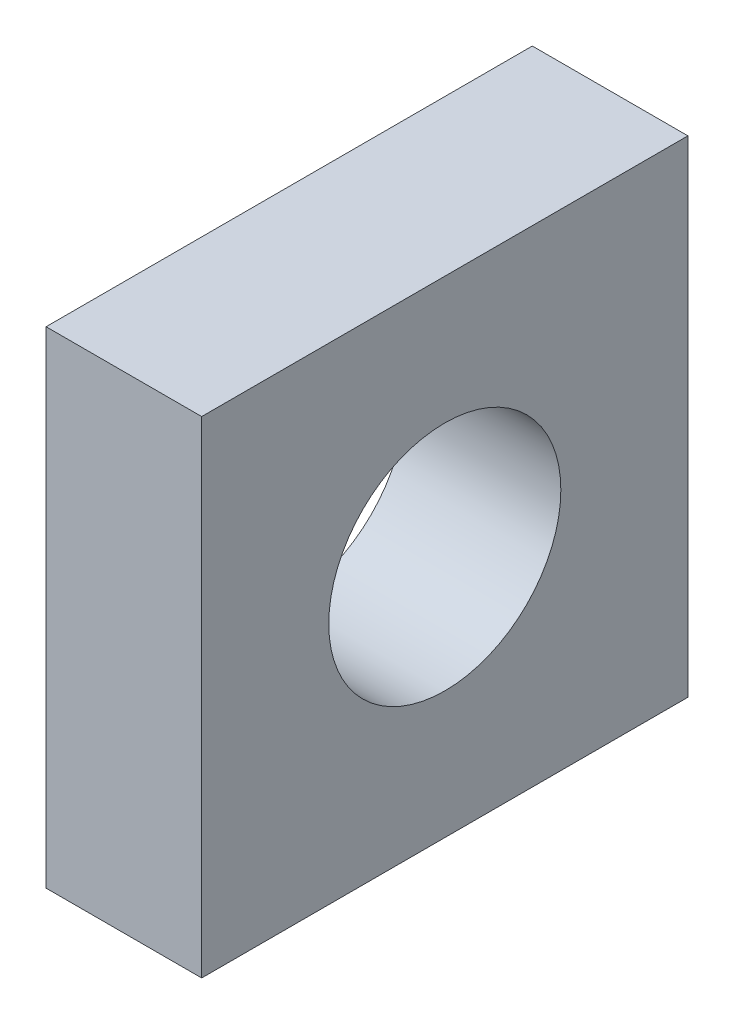
ISO-10303-21;
HEADER;
FILE_DESCRIPTION(('STEP AP214'),'2;1');
FILE_NAME('part.step','',(''),(''),'','','');
FILE_SCHEMA(('AUTOMOTIVE_DESIGN { 1 0 10303 214 1 1 1 1 }'));
ENDSEC;
DATA;
#1=APPLICATION_CONTEXT('core data for automotive mechanical design processes');
#2=APPLICATION_PROTOCOL_DEFINITION('international standard','automotive_design',2000,#1);
#3=PRODUCT_CONTEXT('',#1,'mechanical');
#4=PRODUCT('Part','Part','',(#3));
#5=PRODUCT_RELATED_PRODUCT_CATEGORY('part','',(#4));
#6=PRODUCT_DEFINITION_FORMATION('','',#4);
#7=PRODUCT_DEFINITION_CONTEXT('part definition',#1,'design');
#8=PRODUCT_DEFINITION('design','',#6,#7);
#9=PRODUCT_DEFINITION_SHAPE('','',#8);
#10=(LENGTH_UNIT() NAMED_UNIT(*) SI_UNIT(.MILLI.,.METRE.));
#11=(NAMED_UNIT(*) PLANE_ANGLE_UNIT() SI_UNIT($,.RADIAN.));
#12=(NAMED_UNIT(*) SI_UNIT($,.STERADIAN.) SOLID_ANGLE_UNIT());
#13=UNCERTAINTY_MEASURE_WITH_UNIT(LENGTH_MEASURE(1.E-05),#10,'distance_accuracy_value','');
#14=(GEOMETRIC_REPRESENTATION_CONTEXT(3) GLOBAL_UNCERTAINTY_ASSIGNED_CONTEXT((#13)) GLOBAL_UNIT_ASSIGNED_CONTEXT((#10,
#11,#12)) REPRESENTATION_CONTEXT('',''));
#15=CARTESIAN_POINT('',(0.,0.,0.));
#16=DIRECTION('',(0.,0.,1.));
#17=DIRECTION('',(1.,0.,0.));
#18=AXIS2_PLACEMENT_3D('',#15,#16,#17);
#19=CARTESIAN_POINT('',(6.6,19.,29.));
#20=DIRECTION('',(0.,0.,-1.));
#21=DIRECTION('',(-1.,0.,0.));
#22=AXIS2_PLACEMENT_3D('',#19,#20,#21);
#23=PLANE('',#22);
#24=DIRECTION('',(0.,-1.,0.));
#25=VECTOR('',#24,1.);
#26=CARTESIAN_POINT('',(3.4,19.,29.));
#27=LINE('',#26,#25);
#28=CARTESIAN_POINT('',(3.4,19.,29.));
#29=VERTEX_POINT('',#28);
#30=CARTESIAN_POINT('',(3.4,9.,29.));
#31=VERTEX_POINT('',#30);
#32=EDGE_CURVE('E100',#29,#31,#27,.T.);
#33=ORIENTED_EDGE('',*,*,#32,.F.);
#34=DIRECTION('',(-1.,0.,0.));
#35=VECTOR('',#34,1.);
#36=CARTESIAN_POINT('',(6.6,19.,29.));
#37=LINE('',#36,#35);
#38=CARTESIAN_POINT('',(6.6,19.,29.));
#39=VERTEX_POINT('',#38);
#40=EDGE_CURVE('E11',#39,#29,#37,.T.);
#41=ORIENTED_EDGE('',*,*,#40,.F.);
#42=DIRECTION('',(0.,-1.,0.));
#43=VECTOR('',#42,1.);
#44=CARTESIAN_POINT('',(6.6,19.,29.));
#45=LINE('',#44,#43);
#46=CARTESIAN_POINT('',(6.6,9.,29.));
#47=VERTEX_POINT('',#46);
#48=EDGE_CURVE('E93',#39,#47,#45,.T.);
#49=ORIENTED_EDGE('',*,*,#48,.T.);
#50=DIRECTION('',(-1.,0.,0.));
#51=VECTOR('',#50,1.);
#52=CARTESIAN_POINT('',(6.6,9.,29.));
#53=LINE('',#52,#51);
#54=EDGE_CURVE('E38',#47,#31,#53,.T.);
#55=ORIENTED_EDGE('',*,*,#54,.T.);
#56=EDGE_LOOP('',(#33,#41,#49,#55));
#57=FACE_BOUND('',#56,.T.);
#58=ADVANCED_FACE('F35',(#57),#23,.T.);
#59=CARTESIAN_POINT('',(6.6,19.,39.));
#60=DIRECTION('',(0.,1.,0.));
#61=DIRECTION('',(0.,0.,1.));
#62=AXIS2_PLACEMENT_3D('',#59,#60,#61);
#63=PLANE('',#62);
#64=DIRECTION('',(0.,0.,-1.));
#65=VECTOR('',#64,1.);
#66=CARTESIAN_POINT('',(3.4,19.,39.));
#67=LINE('',#66,#65);
#68=CARTESIAN_POINT('',(3.4,19.,39.));
#69=VERTEX_POINT('',#68);
#70=EDGE_CURVE('E95',#69,#29,#67,.T.);
#71=ORIENTED_EDGE('',*,*,#70,.F.);
#72=DIRECTION('',(-1.,0.,0.));
#73=VECTOR('',#72,1.);
#74=CARTESIAN_POINT('',(6.6,19.,39.));
#75=LINE('',#74,#73);
#76=CARTESIAN_POINT('',(6.6,19.,39.));
#77=VERTEX_POINT('',#76);
#78=EDGE_CURVE('E44',#77,#69,#75,.T.);
#79=ORIENTED_EDGE('',*,*,#78,.F.);
#80=DIRECTION('',(0.,0.,-1.));
#81=VECTOR('',#80,1.);
#82=CARTESIAN_POINT('',(6.6,19.,39.));
#83=LINE('',#82,#81);
#84=EDGE_CURVE('E90',#77,#39,#83,.T.);
#85=ORIENTED_EDGE('',*,*,#84,.T.);
#86=ORIENTED_EDGE('',*,*,#40,.T.);
#87=EDGE_LOOP('',(#71,#79,#85,#86));
#88=FACE_BOUND('',#87,.T.);
#89=ADVANCED_FACE('F111',(#88),#63,.T.);
#90=CARTESIAN_POINT('',(6.6,9.,39.));
#91=DIRECTION('',(0.,0.,1.));
#92=DIRECTION('',(1.,0.,0.));
#93=AXIS2_PLACEMENT_3D('',#90,#91,#92);
#94=PLANE('',#93);
#95=DIRECTION('',(0.,1.,0.));
#96=VECTOR('',#95,1.);
#97=CARTESIAN_POINT('',(3.4,9.,39.));
#98=LINE('',#97,#96);
#99=CARTESIAN_POINT('',(3.4,9.,39.));
#100=VERTEX_POINT('',#99);
#101=EDGE_CURVE('E85',#100,#69,#98,.T.);
#102=ORIENTED_EDGE('',*,*,#101,.F.);
#103=DIRECTION('',(-1.,0.,0.));
#104=VECTOR('',#103,1.);
#105=CARTESIAN_POINT('',(6.6,9.,39.));
#106=LINE('',#105,#104);
#107=CARTESIAN_POINT('',(6.6,9.,39.));
#108=VERTEX_POINT('',#107);
#109=EDGE_CURVE('E80',#108,#100,#106,.T.);
#110=ORIENTED_EDGE('',*,*,#109,.F.);
#111=DIRECTION('',(0.,1.,0.));
#112=VECTOR('',#111,1.);
#113=CARTESIAN_POINT('',(6.6,9.,39.));
#114=LINE('',#113,#112);
#115=EDGE_CURVE('E83',#108,#77,#114,.T.);
#116=ORIENTED_EDGE('',*,*,#115,.T.);
#117=ORIENTED_EDGE('',*,*,#78,.T.);
#118=EDGE_LOOP('',(#102,#110,#116,#117));
#119=FACE_BOUND('',#118,.T.);
#120=ADVANCED_FACE('F82',(#119),#94,.T.);
#121=CARTESIAN_POINT('',(6.6,9.,29.));
#122=DIRECTION('',(0.,-1.,0.));
#123=DIRECTION('',(0.,0.,-1.));
#124=AXIS2_PLACEMENT_3D('',#121,#122,#123);
#125=PLANE('',#124);
#126=DIRECTION('',(0.,0.,1.));
#127=VECTOR('',#126,1.);
#128=CARTESIAN_POINT('',(3.4,9.,29.));
#129=LINE('',#128,#127);
#130=EDGE_CURVE('E103',#31,#100,#129,.T.);
#131=ORIENTED_EDGE('',*,*,#130,.F.);
#132=ORIENTED_EDGE('',*,*,#54,.F.);
#133=DIRECTION('',(0.,0.,1.));
#134=VECTOR('',#133,1.);
#135=CARTESIAN_POINT('',(6.6,9.,29.));
#136=LINE('',#135,#134);
#137=EDGE_CURVE('E89',#47,#108,#136,.T.);
#138=ORIENTED_EDGE('',*,*,#137,.T.);
#139=ORIENTED_EDGE('',*,*,#109,.T.);
#140=EDGE_LOOP('',(#131,#132,#138,#139));
#141=FACE_BOUND('',#140,.T.);
#142=ADVANCED_FACE('F92',(#141),#125,.T.);
#143=CARTESIAN_POINT('',(6.6,0.,0.));
#144=DIRECTION('',(-1.,0.,0.));
#145=DIRECTION('',(0.,0.,1.));
#146=AXIS2_PLACEMENT_3D('',#143,#144,#145);
#147=PLANE('',#146);
#148=CARTESIAN_POINT('',(6.6,14.,34.));
#149=DIRECTION('',(-1.,0.,0.));
#150=DIRECTION('',(0.,0.,-1.));
#151=AXIS2_PLACEMENT_3D('',#148,#149,#150);
#152=CIRCLE('',#151,2.38655);
#153=CARTESIAN_POINT('',(6.6,14.,31.61345));
#154=VERTEX_POINT('',#153);
#155=EDGE_CURVE('E104',#154,#154,#152,.T.);
#156=ORIENTED_EDGE('',*,*,#155,.T.);
#157=EDGE_LOOP('',(#156));
#158=FACE_BOUND('',#157,.T.);
#159=ORIENTED_EDGE('',*,*,#48,.F.);
#160=ORIENTED_EDGE('',*,*,#84,.F.);
#161=ORIENTED_EDGE('',*,*,#115,.F.);
#162=ORIENTED_EDGE('',*,*,#137,.F.);
#163=EDGE_LOOP('',(#159,#160,#161,#162));
#164=FACE_BOUND('',#163,.T.);
#165=ADVANCED_FACE('F88',(#158,#164),#147,.F.);
#166=CARTESIAN_POINT('',(3.4,0.,0.));
#167=DIRECTION('',(-1.,0.,0.));
#168=DIRECTION('',(0.,0.,1.));
#169=AXIS2_PLACEMENT_3D('',#166,#167,#168);
#170=PLANE('',#169);
#171=CARTESIAN_POINT('',(3.4,14.,34.));
#172=DIRECTION('',(-1.,0.,0.));
#173=DIRECTION('',(0.,0.,-1.));
#174=AXIS2_PLACEMENT_3D('',#171,#172,#173);
#175=CIRCLE('',#174,2.38655);
#176=CARTESIAN_POINT('',(3.4,14.,31.61345));
#177=VERTEX_POINT('',#176);
#178=EDGE_CURVE('E141',#177,#177,#175,.T.);
#179=ORIENTED_EDGE('',*,*,#178,.F.);
#180=EDGE_LOOP('',(#179));
#181=FACE_BOUND('',#180,.T.);
#182=ORIENTED_EDGE('',*,*,#32,.T.);
#183=ORIENTED_EDGE('',*,*,#130,.T.);
#184=ORIENTED_EDGE('',*,*,#101,.T.);
#185=ORIENTED_EDGE('',*,*,#70,.T.);
#186=EDGE_LOOP('',(#182,#183,#184,#185));
#187=FACE_BOUND('',#186,.T.);
#188=ADVANCED_FACE('F110',(#181,#187),#170,.T.);
#189=CARTESIAN_POINT('',(6.6,14.,34.));
#190=DIRECTION('',(-1.,0.,0.));
#191=DIRECTION('',(0.,0.,1.));
#192=AXIS2_PLACEMENT_3D('',#189,#190,#191);
#193=CYLINDRICAL_SURFACE('',#192,2.38655);
#194=ORIENTED_EDGE('',*,*,#155,.F.);
#195=EDGE_LOOP('',(#194));
#196=FACE_BOUND('',#195,.T.);
#197=ORIENTED_EDGE('',*,*,#178,.T.);
#198=EDGE_LOOP('',(#197));
#199=FACE_BOUND('',#198,.T.);
#200=ADVANCED_FACE('F129',(#196,#199),#193,.F.);
#201=CLOSED_SHELL('',(#58,#89,#120,#142,#165,#188,#200));
#202=MANIFOLD_SOLID_BREP('B2',#201);
#203=ADVANCED_BREP_SHAPE_REPRESENTATION('',(#18,#202),#14);
#204=SHAPE_DEFINITION_REPRESENTATION(#9,#203);
ENDSEC;
END-ISO-10303-21;
